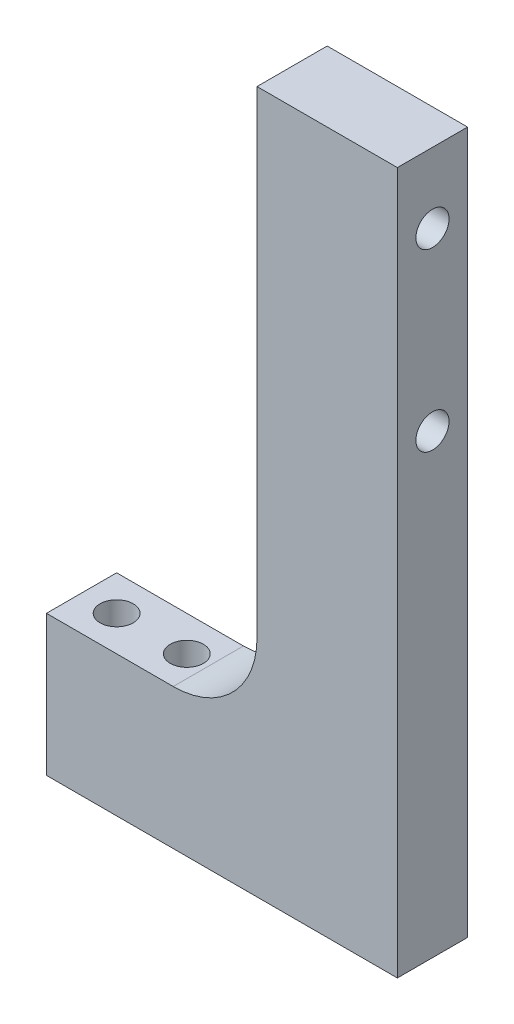
ISO-10303-21;
HEADER;
FILE_DESCRIPTION(('STEP AP214'),'2;1');
FILE_NAME('part.step','',(''),(''),'','','');
FILE_SCHEMA(('AUTOMOTIVE_DESIGN { 1 0 10303 214 1 1 1 1 }'));
ENDSEC;
DATA;
#1=APPLICATION_CONTEXT('core data for automotive mechanical design processes');
#2=APPLICATION_PROTOCOL_DEFINITION('international standard','automotive_design',2000,#1);
#3=PRODUCT_CONTEXT('',#1,'mechanical');
#4=PRODUCT('Part','Part','',(#3));
#5=PRODUCT_RELATED_PRODUCT_CATEGORY('part','',(#4));
#6=PRODUCT_DEFINITION_FORMATION('','',#4);
#7=PRODUCT_DEFINITION_CONTEXT('part definition',#1,'design');
#8=PRODUCT_DEFINITION('design','',#6,#7);
#9=PRODUCT_DEFINITION_SHAPE('','',#8);
#10=(LENGTH_UNIT() NAMED_UNIT(*) SI_UNIT(.MILLI.,.METRE.));
#11=(NAMED_UNIT(*) PLANE_ANGLE_UNIT() SI_UNIT($,.RADIAN.));
#12=(NAMED_UNIT(*) SI_UNIT($,.STERADIAN.) SOLID_ANGLE_UNIT());
#13=UNCERTAINTY_MEASURE_WITH_UNIT(LENGTH_MEASURE(1.E-05),#10,'distance_accuracy_value','');
#14=(GEOMETRIC_REPRESENTATION_CONTEXT(3) GLOBAL_UNCERTAINTY_ASSIGNED_CONTEXT((#13)) GLOBAL_UNIT_ASSIGNED_CONTEXT((#10,
#11,#12)) REPRESENTATION_CONTEXT('',''));
#15=CARTESIAN_POINT('',(0.,0.,0.));
#16=DIRECTION('',(0.,0.,1.));
#17=DIRECTION('',(1.,0.,0.));
#18=AXIS2_PLACEMENT_3D('',#15,#16,#17);
#19=CARTESIAN_POINT('',(-50.8,194.731808122781,25.4));
#20=DIRECTION('',(0.,-1.,0.));
#21=DIRECTION('',(0.,0.,-1.));
#22=AXIS2_PLACEMENT_3D('',#19,#20,#21);
#23=PLANE('',#22);
#24=DIRECTION('',(-1.,0.,0.));
#25=VECTOR('',#24,1.);
#26=CARTESIAN_POINT('',(-50.8,194.731808122781,0.));
#27=LINE('',#26,#25);
#28=CARTESIAN_POINT('',(0.,194.731808122781,0.));
#29=VERTEX_POINT('',#28);
#30=CARTESIAN_POINT('',(-50.8,194.731808122781,0.));
#31=VERTEX_POINT('',#30);
#32=EDGE_CURVE('E122',#29,#31,#27,.T.);
#33=ORIENTED_EDGE('',*,*,#32,.T.);
#34=DIRECTION('',(0.,0.,-1.));
#35=VECTOR('',#34,1.);
#36=CARTESIAN_POINT('',(-50.8,194.731808122781,25.4));
#37=LINE('',#36,#35);
#38=CARTESIAN_POINT('',(-50.8,194.731808122781,25.4));
#39=VERTEX_POINT('',#38);
#40=EDGE_CURVE('E103',#39,#31,#37,.T.);
#41=ORIENTED_EDGE('',*,*,#40,.F.);
#42=DIRECTION('',(-1.,0.,0.));
#43=VECTOR('',#42,1.);
#44=CARTESIAN_POINT('',(-50.8,194.731808122781,25.4));
#45=LINE('',#44,#43);
#46=CARTESIAN_POINT('',(0.,194.731808122781,25.4));
#47=VERTEX_POINT('',#46);
#48=EDGE_CURVE('E109',#47,#39,#45,.T.);
#49=ORIENTED_EDGE('',*,*,#48,.F.);
#50=DIRECTION('',(0.,0.,-1.));
#51=VECTOR('',#50,1.);
#52=CARTESIAN_POINT('',(0.,194.731808122781,25.4));
#53=LINE('',#52,#51);
#54=EDGE_CURVE('E145',#47,#29,#53,.T.);
#55=ORIENTED_EDGE('',*,*,#54,.T.);
#56=EDGE_LOOP('',(#33,#41,#49,#55));
#57=FACE_BOUND('',#56,.T.);
#58=ADVANCED_FACE('F43',(#57),#23,.F.);
#59=CARTESIAN_POINT('',(-50.8,-8.46819187721898,25.4));
#60=DIRECTION('',(1.,0.,0.));
#61=DIRECTION('',(0.,0.,-1.));
#62=AXIS2_PLACEMENT_3D('',#59,#60,#61);
#63=PLANE('',#62);
#64=CARTESIAN_POINT('',(-50.8,169.331808122781,12.7));
#65=DIRECTION('',(-1.,0.,0.));
#66=DIRECTION('',(0.,0.,1.));
#67=AXIS2_PLACEMENT_3D('',#64,#65,#66);
#68=CIRCLE('',#67,5.99999999999998);
#69=CARTESIAN_POINT('',(-50.8,169.331808122781,18.7));
#70=VERTEX_POINT('',#69);
#71=EDGE_CURVE('E202',#70,#70,#68,.T.);
#72=ORIENTED_EDGE('',*,*,#71,.F.);
#73=EDGE_LOOP('',(#72));
#74=FACE_BOUND('',#73,.T.);
#75=CARTESIAN_POINT('',(-50.8,105.831808122781,12.7));
#76=DIRECTION('',(-1.,0.,0.));
#77=DIRECTION('',(0.,0.,1.));
#78=AXIS2_PLACEMENT_3D('',#75,#76,#77);
#79=CIRCLE('',#78,5.99999999999999);
#80=CARTESIAN_POINT('',(-50.8,105.831808122781,18.7));
#81=VERTEX_POINT('',#80);
#82=EDGE_CURVE('E194',#81,#81,#79,.T.);
#83=ORIENTED_EDGE('',*,*,#82,.F.);
#84=EDGE_LOOP('',(#83));
#85=FACE_BOUND('',#84,.T.);
#86=DIRECTION('',(0.,-1.,0.));
#87=VECTOR('',#86,1.);
#88=CARTESIAN_POINT('',(-50.8,-8.46819187721898,0.));
#89=LINE('',#88,#87);
#90=CARTESIAN_POINT('',(-50.8,21.851808122781,0.));
#91=VERTEX_POINT('',#90);
#92=EDGE_CURVE('E159',#31,#91,#89,.T.);
#93=ORIENTED_EDGE('',*,*,#92,.T.);
#94=DIRECTION('',(0.,0.,-1.));
#95=VECTOR('',#94,1.);
#96=CARTESIAN_POINT('',(-50.8,21.851808122781,25.4));
#97=LINE('',#96,#95);
#98=CARTESIAN_POINT('',(-50.8,21.851808122781,25.4));
#99=VERTEX_POINT('',#98);
#100=EDGE_CURVE('E59',#91,#99,#97,.F.);
#101=ORIENTED_EDGE('',*,*,#100,.T.);
#102=DIRECTION('',(0.,-1.,0.));
#103=VECTOR('',#102,1.);
#104=CARTESIAN_POINT('',(-50.8,-8.46819187721898,25.4));
#105=LINE('',#104,#103);
#106=EDGE_CURVE('E99',#39,#99,#105,.T.);
#107=ORIENTED_EDGE('',*,*,#106,.F.);
#108=ORIENTED_EDGE('',*,*,#40,.T.);
#109=EDGE_LOOP('',(#93,#101,#107,#108));
#110=FACE_BOUND('',#109,.T.);
#111=ADVANCED_FACE('F101',(#74,#85,#110),#63,.F.);
#112=CARTESIAN_POINT('',(-127.,-8.46819187721898,25.4));
#113=DIRECTION('',(0.,-1.,0.));
#114=DIRECTION('',(0.,0.,-1.));
#115=AXIS2_PLACEMENT_3D('',#112,#113,#114);
#116=PLANE('',#115);
#117=CARTESIAN_POINT('',(-114.3,-8.46819187721898,12.7));
#118=DIRECTION('',(0.,1.,0.));
#119=DIRECTION('',(0.,0.,1.));
#120=AXIS2_PLACEMENT_3D('',#117,#118,#119);
#121=CIRCLE('',#120,5.99999999999999);
#122=CARTESIAN_POINT('',(-114.3,-8.46819187721898,18.7));
#123=VERTEX_POINT('',#122);
#124=EDGE_CURVE('E186',#123,#123,#121,.T.);
#125=ORIENTED_EDGE('',*,*,#124,.F.);
#126=EDGE_LOOP('',(#125));
#127=FACE_BOUND('',#126,.T.);
#128=CARTESIAN_POINT('',(-88.9,-8.46819187721898,12.7));
#129=DIRECTION('',(0.,1.,0.));
#130=DIRECTION('',(0.,0.,1.));
#131=AXIS2_PLACEMENT_3D('',#128,#129,#130);
#132=CIRCLE('',#131,5.99999999999999);
#133=CARTESIAN_POINT('',(-88.9,-8.46819187721898,18.7));
#134=VERTEX_POINT('',#133);
#135=EDGE_CURVE('E178',#134,#134,#132,.T.);
#136=ORIENTED_EDGE('',*,*,#135,.F.);
#137=EDGE_LOOP('',(#136));
#138=FACE_BOUND('',#137,.T.);
#139=DIRECTION('',(-1.,0.,0.));
#140=VECTOR('',#139,1.);
#141=CARTESIAN_POINT('',(-127.,-8.46819187721898,25.4));
#142=LINE('',#141,#140);
#143=CARTESIAN_POINT('',(-81.12,-8.46819187721898,25.4));
#144=VERTEX_POINT('',#143);
#145=CARTESIAN_POINT('',(-127.,-8.46819187721898,25.4));
#146=VERTEX_POINT('',#145);
#147=EDGE_CURVE('E108',#144,#146,#142,.T.);
#148=ORIENTED_EDGE('',*,*,#147,.F.);
#149=DIRECTION('',(0.,0.,-1.));
#150=VECTOR('',#149,1.);
#151=CARTESIAN_POINT('',(-81.12,-8.46819187721898,0.));
#152=LINE('',#151,#150);
#153=CARTESIAN_POINT('',(-81.12,-8.46819187721898,0.));
#154=VERTEX_POINT('',#153);
#155=EDGE_CURVE('E124',#144,#154,#152,.T.);
#156=ORIENTED_EDGE('',*,*,#155,.T.);
#157=DIRECTION('',(-1.,0.,0.));
#158=VECTOR('',#157,1.);
#159=CARTESIAN_POINT('',(-127.,-8.46819187721898,0.));
#160=LINE('',#159,#158);
#161=CARTESIAN_POINT('',(-127.,-8.46819187721898,0.));
#162=VERTEX_POINT('',#161);
#163=EDGE_CURVE('E156',#154,#162,#160,.T.);
#164=ORIENTED_EDGE('',*,*,#163,.T.);
#165=DIRECTION('',(0.,0.,-1.));
#166=VECTOR('',#165,1.);
#167=CARTESIAN_POINT('',(-127.,-8.46819187721898,25.4));
#168=LINE('',#167,#166);
#169=EDGE_CURVE('E125',#146,#162,#168,.T.);
#170=ORIENTED_EDGE('',*,*,#169,.F.);
#171=EDGE_LOOP('',(#148,#156,#164,#170));
#172=FACE_BOUND('',#171,.T.);
#173=ADVANCED_FACE('F211',(#127,#138,#172),#116,.F.);
#174=CARTESIAN_POINT('',(-127.,-59.268191877219,25.4));
#175=DIRECTION('',(1.,0.,0.));
#176=DIRECTION('',(0.,0.,-1.));
#177=AXIS2_PLACEMENT_3D('',#174,#175,#176);
#178=PLANE('',#177);
#179=DIRECTION('',(0.,-1.,0.));
#180=VECTOR('',#179,1.);
#181=CARTESIAN_POINT('',(-127.,-59.268191877219,0.));
#182=LINE('',#181,#180);
#183=CARTESIAN_POINT('',(-127.,-59.268191877219,0.));
#184=VERTEX_POINT('',#183);
#185=EDGE_CURVE('E153',#162,#184,#182,.T.);
#186=ORIENTED_EDGE('',*,*,#185,.T.);
#187=DIRECTION('',(0.,0.,-1.));
#188=VECTOR('',#187,1.);
#189=CARTESIAN_POINT('',(-127.,-59.268191877219,25.4));
#190=LINE('',#189,#188);
#191=CARTESIAN_POINT('',(-127.,-59.268191877219,25.4));
#192=VERTEX_POINT('',#191);
#193=EDGE_CURVE('E132',#192,#184,#190,.T.);
#194=ORIENTED_EDGE('',*,*,#193,.F.);
#195=DIRECTION('',(0.,-1.,0.));
#196=VECTOR('',#195,1.);
#197=CARTESIAN_POINT('',(-127.,-59.268191877219,25.4));
#198=LINE('',#197,#196);
#199=EDGE_CURVE('E170',#146,#192,#198,.T.);
#200=ORIENTED_EDGE('',*,*,#199,.F.);
#201=ORIENTED_EDGE('',*,*,#169,.T.);
#202=EDGE_LOOP('',(#186,#194,#200,#201));
#203=FACE_BOUND('',#202,.T.);
#204=ADVANCED_FACE('F236',(#203),#178,.F.);
#205=CARTESIAN_POINT('',(0.,-59.268191877219,25.4));
#206=DIRECTION('',(0.,1.,0.));
#207=DIRECTION('',(-1.,0.,0.));
#208=AXIS2_PLACEMENT_3D('',#205,#206,#207);
#209=PLANE('',#208);
#210=CARTESIAN_POINT('',(-114.3,-59.268191877219,12.7));
#211=DIRECTION('',(0.,1.,0.));
#212=DIRECTION('',(0.,0.,1.));
#213=AXIS2_PLACEMENT_3D('',#210,#211,#212);
#214=CIRCLE('',#213,5.99999999999999);
#215=CARTESIAN_POINT('',(-114.3,-59.268191877219,18.7));
#216=VERTEX_POINT('',#215);
#217=EDGE_CURVE('E182',#216,#216,#214,.T.);
#218=ORIENTED_EDGE('',*,*,#217,.T.);
#219=EDGE_LOOP('',(#218));
#220=FACE_BOUND('',#219,.T.);
#221=CARTESIAN_POINT('',(-88.9,-59.268191877219,12.7));
#222=DIRECTION('',(0.,1.,0.));
#223=DIRECTION('',(0.,0.,1.));
#224=AXIS2_PLACEMENT_3D('',#221,#222,#223);
#225=CIRCLE('',#224,5.99999999999999);
#226=CARTESIAN_POINT('',(-88.9,-59.268191877219,18.7));
#227=VERTEX_POINT('',#226);
#228=EDGE_CURVE('E164',#227,#227,#225,.T.);
#229=ORIENTED_EDGE('',*,*,#228,.T.);
#230=EDGE_LOOP('',(#229));
#231=FACE_BOUND('',#230,.T.);
#232=DIRECTION('',(1.,0.,0.));
#233=VECTOR('',#232,1.);
#234=CARTESIAN_POINT('',(0.,-59.268191877219,0.));
#235=LINE('',#234,#233);
#236=CARTESIAN_POINT('',(0.,-59.268191877219,0.));
#237=VERTEX_POINT('',#236);
#238=EDGE_CURVE('E150',#184,#237,#235,.T.);
#239=ORIENTED_EDGE('',*,*,#238,.T.);
#240=DIRECTION('',(0.,0.,-1.));
#241=VECTOR('',#240,1.);
#242=CARTESIAN_POINT('',(0.,-59.268191877219,25.4));
#243=LINE('',#242,#241);
#244=CARTESIAN_POINT('',(0.,-59.268191877219,25.4));
#245=VERTEX_POINT('',#244);
#246=EDGE_CURVE('E141',#245,#237,#243,.T.);
#247=ORIENTED_EDGE('',*,*,#246,.F.);
#248=DIRECTION('',(1.,0.,0.));
#249=VECTOR('',#248,1.);
#250=CARTESIAN_POINT('',(0.,-59.268191877219,25.4));
#251=LINE('',#250,#249);
#252=EDGE_CURVE('E167',#192,#245,#251,.T.);
#253=ORIENTED_EDGE('',*,*,#252,.F.);
#254=ORIENTED_EDGE('',*,*,#193,.T.);
#255=EDGE_LOOP('',(#239,#247,#253,#254));
#256=FACE_BOUND('',#255,.T.);
#257=ADVANCED_FACE('F240',(#220,#231,#256),#209,.F.);
#258=CARTESIAN_POINT('',(0.,194.731808122781,25.4));
#259=DIRECTION('',(-1.,0.,0.));
#260=DIRECTION('',(0.,-1.,0.));
#261=AXIS2_PLACEMENT_3D('',#258,#259,#260);
#262=PLANE('',#261);
#263=CARTESIAN_POINT('',(0.,169.331808122781,12.7));
#264=DIRECTION('',(-1.,0.,0.));
#265=DIRECTION('',(0.,0.,1.));
#266=AXIS2_PLACEMENT_3D('',#263,#264,#265);
#267=CIRCLE('',#266,5.99999999999998);
#268=CARTESIAN_POINT('',(0.,169.331808122781,18.7));
#269=VERTEX_POINT('',#268);
#270=EDGE_CURVE('E198',#269,#269,#267,.T.);
#271=ORIENTED_EDGE('',*,*,#270,.T.);
#272=EDGE_LOOP('',(#271));
#273=FACE_BOUND('',#272,.T.);
#274=CARTESIAN_POINT('',(0.,105.831808122781,12.7));
#275=DIRECTION('',(-1.,0.,0.));
#276=DIRECTION('',(0.,0.,1.));
#277=AXIS2_PLACEMENT_3D('',#274,#275,#276);
#278=CIRCLE('',#277,5.99999999999999);
#279=CARTESIAN_POINT('',(0.,105.831808122781,18.7));
#280=VERTEX_POINT('',#279);
#281=EDGE_CURVE('E190',#280,#280,#278,.T.);
#282=ORIENTED_EDGE('',*,*,#281,.T.);
#283=EDGE_LOOP('',(#282));
#284=FACE_BOUND('',#283,.T.);
#285=DIRECTION('',(0.,1.,0.));
#286=VECTOR('',#285,1.);
#287=CARTESIAN_POINT('',(0.,194.731808122781,0.));
#288=LINE('',#287,#286);
#289=EDGE_CURVE('E119',#237,#29,#288,.T.);
#290=ORIENTED_EDGE('',*,*,#289,.T.);
#291=ORIENTED_EDGE('',*,*,#54,.F.);
#292=DIRECTION('',(0.,1.,0.));
#293=VECTOR('',#292,1.);
#294=CARTESIAN_POINT('',(0.,194.731808122781,25.4));
#295=LINE('',#294,#293);
#296=EDGE_CURVE('E114',#245,#47,#295,.T.);
#297=ORIENTED_EDGE('',*,*,#296,.F.);
#298=ORIENTED_EDGE('',*,*,#246,.T.);
#299=EDGE_LOOP('',(#290,#291,#297,#298));
#300=FACE_BOUND('',#299,.T.);
#301=ADVANCED_FACE('F244',(#273,#284,#300),#262,.F.);
#302=CARTESIAN_POINT('',(0.,0.,25.4));
#303=DIRECTION('',(0.,0.,-1.));
#304=DIRECTION('',(-1.,0.,0.));
#305=AXIS2_PLACEMENT_3D('',#302,#303,#304);
#306=PLANE('',#305);
#307=ORIENTED_EDGE('',*,*,#48,.T.);
#308=ORIENTED_EDGE('',*,*,#106,.T.);
#309=CARTESIAN_POINT('',(-81.12,21.851808122781,25.4));
#310=DIRECTION('',(0.,0.,-1.));
#311=DIRECTION('',(-1.,0.,0.));
#312=AXIS2_PLACEMENT_3D('',#309,#310,#311);
#313=CIRCLE('',#312,30.32);
#314=EDGE_CURVE('E11',#99,#144,#313,.T.);
#315=ORIENTED_EDGE('',*,*,#314,.T.);
#316=ORIENTED_EDGE('',*,*,#147,.T.);
#317=ORIENTED_EDGE('',*,*,#199,.T.);
#318=ORIENTED_EDGE('',*,*,#252,.T.);
#319=ORIENTED_EDGE('',*,*,#296,.T.);
#320=EDGE_LOOP('',(#307,#308,#315,#316,#317,#318,#319));
#321=FACE_BOUND('',#320,.T.);
#322=ADVANCED_FACE('F112',(#321),#306,.F.);
#323=CARTESIAN_POINT('',(0.,0.,0.));
#324=DIRECTION('',(0.,0.,-1.));
#325=DIRECTION('',(-1.,0.,0.));
#326=AXIS2_PLACEMENT_3D('',#323,#324,#325);
#327=PLANE('',#326);
#328=ORIENTED_EDGE('',*,*,#32,.F.);
#329=ORIENTED_EDGE('',*,*,#289,.F.);
#330=ORIENTED_EDGE('',*,*,#238,.F.);
#331=ORIENTED_EDGE('',*,*,#185,.F.);
#332=ORIENTED_EDGE('',*,*,#163,.F.);
#333=CARTESIAN_POINT('',(-81.12,21.851808122781,0.));
#334=DIRECTION('',(0.,0.,-1.));
#335=DIRECTION('',(-1.,0.,0.));
#336=AXIS2_PLACEMENT_3D('',#333,#334,#335);
#337=CIRCLE('',#336,30.32);
#338=EDGE_CURVE('E52',#154,#91,#337,.F.);
#339=ORIENTED_EDGE('',*,*,#338,.T.);
#340=ORIENTED_EDGE('',*,*,#92,.F.);
#341=EDGE_LOOP('',(#328,#329,#330,#331,#332,#339,#340));
#342=FACE_BOUND('',#341,.T.);
#343=ADVANCED_FACE('F249',(#342),#327,.T.);
#344=CARTESIAN_POINT('',(-88.9,-8.46819187721898,12.7));
#345=DIRECTION('',(0.,1.,0.));
#346=DIRECTION('',(0.,0.,1.));
#347=AXIS2_PLACEMENT_3D('',#344,#345,#346);
#348=CYLINDRICAL_SURFACE('',#347,5.99999999999999);
#349=ORIENTED_EDGE('',*,*,#228,.F.);
#350=EDGE_LOOP('',(#349));
#351=FACE_BOUND('',#350,.T.);
#352=ORIENTED_EDGE('',*,*,#135,.T.);
#353=EDGE_LOOP('',(#352));
#354=FACE_BOUND('',#353,.T.);
#355=ADVANCED_FACE('F226',(#351,#354),#348,.F.);
#356=CARTESIAN_POINT('',(-114.3,-8.46819187721898,12.7));
#357=DIRECTION('',(0.,1.,0.));
#358=DIRECTION('',(0.,0.,1.));
#359=AXIS2_PLACEMENT_3D('',#356,#357,#358);
#360=CYLINDRICAL_SURFACE('',#359,5.99999999999999);
#361=ORIENTED_EDGE('',*,*,#217,.F.);
#362=EDGE_LOOP('',(#361));
#363=FACE_BOUND('',#362,.T.);
#364=ORIENTED_EDGE('',*,*,#124,.T.);
#365=EDGE_LOOP('',(#364));
#366=FACE_BOUND('',#365,.T.);
#367=ADVANCED_FACE('F217',(#363,#366),#360,.F.);
#368=CARTESIAN_POINT('',(-50.8,105.831808122781,12.7));
#369=DIRECTION('',(-1.,0.,0.));
#370=DIRECTION('',(0.,0.,1.));
#371=AXIS2_PLACEMENT_3D('',#368,#369,#370);
#372=CYLINDRICAL_SURFACE('',#371,5.99999999999999);
#373=ORIENTED_EDGE('',*,*,#281,.F.);
#374=EDGE_LOOP('',(#373));
#375=FACE_BOUND('',#374,.T.);
#376=ORIENTED_EDGE('',*,*,#82,.T.);
#377=EDGE_LOOP('',(#376));
#378=FACE_BOUND('',#377,.T.);
#379=ADVANCED_FACE('F215',(#375,#378),#372,.F.);
#380=CARTESIAN_POINT('',(-50.8,169.331808122781,12.7));
#381=DIRECTION('',(-1.,0.,0.));
#382=DIRECTION('',(0.,0.,1.));
#383=AXIS2_PLACEMENT_3D('',#380,#381,#382);
#384=CYLINDRICAL_SURFACE('',#383,5.99999999999998);
#385=ORIENTED_EDGE('',*,*,#270,.F.);
#386=EDGE_LOOP('',(#385));
#387=FACE_BOUND('',#386,.T.);
#388=ORIENTED_EDGE('',*,*,#71,.T.);
#389=EDGE_LOOP('',(#388));
#390=FACE_BOUND('',#389,.T.);
#391=ADVANCED_FACE('F207',(#387,#390),#384,.F.);
#392=CARTESIAN_POINT('',(-81.12,21.851808122781,25.4));
#393=DIRECTION('',(0.,0.,1.));
#394=DIRECTION('',(1.,0.,0.));
#395=AXIS2_PLACEMENT_3D('',#392,#393,#394);
#396=CYLINDRICAL_SURFACE('',#395,30.32);
#397=ORIENTED_EDGE('',*,*,#314,.F.);
#398=ORIENTED_EDGE('',*,*,#100,.F.);
#399=ORIENTED_EDGE('',*,*,#338,.F.);
#400=ORIENTED_EDGE('',*,*,#155,.F.);
#401=EDGE_LOOP('',(#397,#398,#399,#400));
#402=FACE_BOUND('',#401,.T.);
#403=ADVANCED_FACE('F45',(#402),#396,.F.);
#404=CLOSED_SHELL('',(#58,#111,#173,#204,#257,#301,#322,#343,#355,#367,#379,#391,#403));
#405=MANIFOLD_SOLID_BREP('B2',#404);
#406=ADVANCED_BREP_SHAPE_REPRESENTATION('',(#18,#405),#14);
#407=SHAPE_DEFINITION_REPRESENTATION(#9,#406);
ENDSEC;
END-ISO-10303-21;
